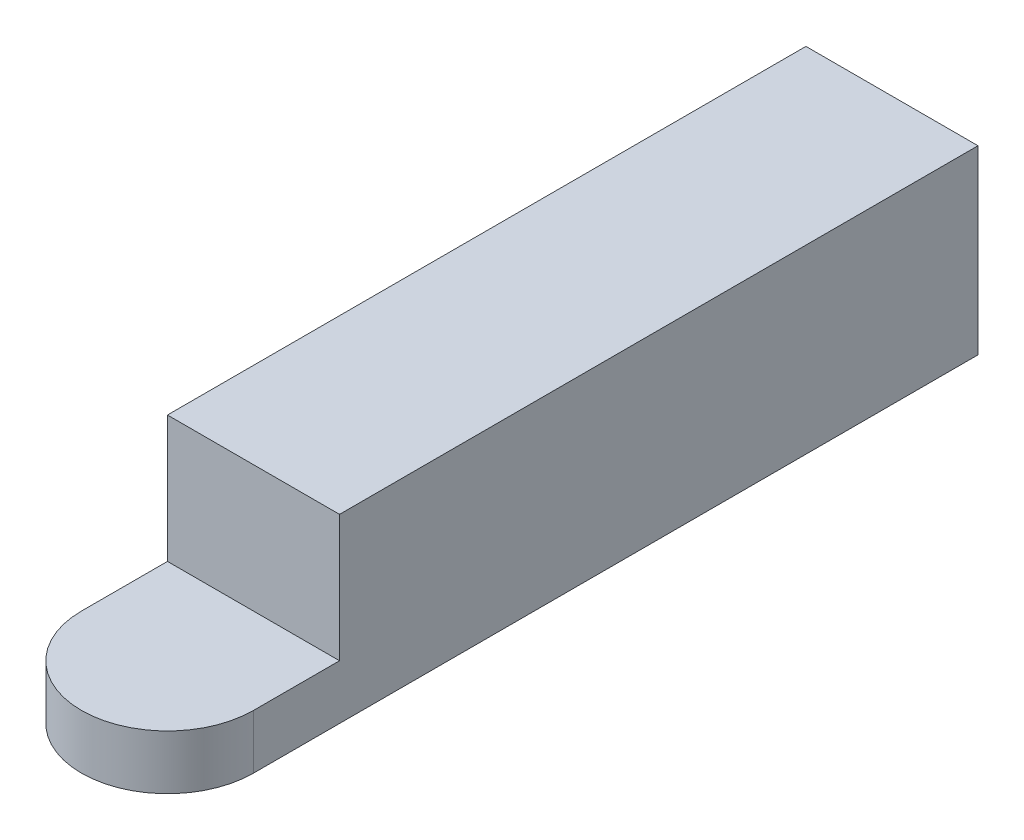
ISO-10303-21;
HEADER;
FILE_DESCRIPTION(('STEP AP214'),'2;1');
FILE_NAME('part.step','',(''),(''),'','','');
FILE_SCHEMA(('AUTOMOTIVE_DESIGN { 1 0 10303 214 1 1 1 1 }'));
ENDSEC;
DATA;
#1=APPLICATION_CONTEXT('core data for automotive mechanical design processes');
#2=APPLICATION_PROTOCOL_DEFINITION('international standard','automotive_design',2000,#1);
#3=PRODUCT_CONTEXT('',#1,'mechanical');
#4=PRODUCT('Part','Part','',(#3));
#5=PRODUCT_RELATED_PRODUCT_CATEGORY('part','',(#4));
#6=PRODUCT_DEFINITION_FORMATION('','',#4);
#7=PRODUCT_DEFINITION_CONTEXT('part definition',#1,'design');
#8=PRODUCT_DEFINITION('design','',#6,#7);
#9=PRODUCT_DEFINITION_SHAPE('','',#8);
#10=(LENGTH_UNIT() NAMED_UNIT(*) SI_UNIT(.MILLI.,.METRE.));
#11=(NAMED_UNIT(*) PLANE_ANGLE_UNIT() SI_UNIT($,.RADIAN.));
#12=(NAMED_UNIT(*) SI_UNIT($,.STERADIAN.) SOLID_ANGLE_UNIT());
#13=UNCERTAINTY_MEASURE_WITH_UNIT(LENGTH_MEASURE(1.E-05),#10,'distance_accuracy_value','');
#14=(GEOMETRIC_REPRESENTATION_CONTEXT(3) GLOBAL_UNCERTAINTY_ASSIGNED_CONTEXT((#13)) GLOBAL_UNIT_ASSIGNED_CONTEXT((#10,
#11,#12)) REPRESENTATION_CONTEXT('',''));
#15=CARTESIAN_POINT('',(0.,0.,0.));
#16=DIRECTION('',(0.,0.,1.));
#17=DIRECTION('',(1.,0.,0.));
#18=AXIS2_PLACEMENT_3D('',#15,#16,#17);
#19=CARTESIAN_POINT('',(4.75,10.,0.));
#20=DIRECTION('',(-1.,0.,0.));
#21=DIRECTION('',(0.,0.,1.));
#22=AXIS2_PLACEMENT_3D('',#19,#20,#21);
#23=PLANE('',#22);
#24=DIRECTION('',(0.,1.,0.));
#25=VECTOR('',#24,1.);
#26=CARTESIAN_POINT('',(4.75,3.,-4.75));
#27=LINE('',#26,#25);
#28=CARTESIAN_POINT('',(4.75,3.,-4.75));
#29=VERTEX_POINT('',#28);
#30=CARTESIAN_POINT('',(4.75,10.,-4.75));
#31=VERTEX_POINT('',#30);
#32=EDGE_CURVE('E165',#29,#31,#27,.T.);
#33=ORIENTED_EDGE('',*,*,#32,.F.);
#34=DIRECTION('',(0.,0.,-1.));
#35=VECTOR('',#34,1.);
#36=CARTESIAN_POINT('',(4.75,3.,0.));
#37=LINE('',#36,#35);
#38=CARTESIAN_POINT('',(4.75,3.,0.));
#39=VERTEX_POINT('',#38);
#40=EDGE_CURVE('E139',#39,#29,#37,.T.);
#41=ORIENTED_EDGE('',*,*,#40,.F.);
#42=DIRECTION('',(0.,-1.,0.));
#43=VECTOR('',#42,1.);
#44=CARTESIAN_POINT('',(4.75,10.,0.));
#45=LINE('',#44,#43);
#46=CARTESIAN_POINT('',(4.75,0.,0.));
#47=VERTEX_POINT('',#46);
#48=EDGE_CURVE('E103',#39,#47,#45,.T.);
#49=ORIENTED_EDGE('',*,*,#48,.T.);
#50=DIRECTION('',(0.,0.,-1.));
#51=VECTOR('',#50,1.);
#52=CARTESIAN_POINT('',(4.75,0.,0.));
#53=LINE('',#52,#51);
#54=CARTESIAN_POINT('',(4.75,0.,-40.));
#55=VERTEX_POINT('',#54);
#56=EDGE_CURVE('E101',#47,#55,#53,.T.);
#57=ORIENTED_EDGE('',*,*,#56,.T.);
#58=DIRECTION('',(0.,-1.,0.));
#59=VECTOR('',#58,1.);
#60=CARTESIAN_POINT('',(4.75,10.,-40.));
#61=LINE('',#60,#59);
#62=CARTESIAN_POINT('',(4.75,10.,-40.));
#63=VERTEX_POINT('',#62);
#64=EDGE_CURVE('E128',#63,#55,#61,.T.);
#65=ORIENTED_EDGE('',*,*,#64,.F.);
#66=DIRECTION('',(0.,0.,-1.));
#67=VECTOR('',#66,1.);
#68=CARTESIAN_POINT('',(4.75,10.,0.));
#69=LINE('',#68,#67);
#70=EDGE_CURVE('E117',#31,#63,#69,.T.);
#71=ORIENTED_EDGE('',*,*,#70,.F.);
#72=EDGE_LOOP('',(#33,#41,#49,#57,#65,#71));
#73=FACE_BOUND('',#72,.T.);
#74=ADVANCED_FACE('F58',(#73),#23,.F.);
#75=CARTESIAN_POINT('',(0.,10.,0.));
#76=DIRECTION('',(0.,1.,0.));
#77=DIRECTION('',(0.,0.,1.));
#78=AXIS2_PLACEMENT_3D('',#75,#76,#77);
#79=PLANE('',#78);
#80=DIRECTION('',(-1.,0.,0.));
#81=VECTOR('',#80,1.);
#82=CARTESIAN_POINT('',(0.,10.,-4.75));
#83=LINE('',#82,#81);
#84=CARTESIAN_POINT('',(-4.75,10.,-4.75));
#85=VERTEX_POINT('',#84);
#86=EDGE_CURVE('E159',#31,#85,#83,.T.);
#87=ORIENTED_EDGE('',*,*,#86,.F.);
#88=ORIENTED_EDGE('',*,*,#70,.T.);
#89=DIRECTION('',(-1.,0.,0.));
#90=VECTOR('',#89,1.);
#91=CARTESIAN_POINT('',(4.75,10.,-40.));
#92=LINE('',#91,#90);
#93=CARTESIAN_POINT('',(-4.75,10.,-40.));
#94=VERTEX_POINT('',#93);
#95=EDGE_CURVE('E82',#63,#94,#92,.T.);
#96=ORIENTED_EDGE('',*,*,#95,.T.);
#97=DIRECTION('',(0.,0.,1.));
#98=VECTOR('',#97,1.);
#99=CARTESIAN_POINT('',(-4.75,10.,0.));
#100=LINE('',#99,#98);
#101=EDGE_CURVE('E111',#94,#85,#100,.T.);
#102=ORIENTED_EDGE('',*,*,#101,.T.);
#103=EDGE_LOOP('',(#87,#88,#96,#102));
#104=FACE_BOUND('',#103,.T.);
#105=ADVANCED_FACE('F173',(#104),#79,.T.);
#106=CARTESIAN_POINT('',(0.,3.,0.));
#107=DIRECTION('',(0.,-1.,0.));
#108=DIRECTION('',(0.,0.,-1.));
#109=AXIS2_PLACEMENT_3D('',#106,#107,#108);
#110=CYLINDRICAL_SURFACE('',#109,4.75);
#111=ORIENTED_EDGE('',*,*,#48,.F.);
#112=CARTESIAN_POINT('',(0.,3.,0.));
#113=DIRECTION('',(0.,1.,0.));
#114=DIRECTION('',(0.,0.,1.));
#115=AXIS2_PLACEMENT_3D('',#112,#113,#114);
#116=CIRCLE('',#115,4.75);
#117=CARTESIAN_POINT('',(-4.75,3.,0.));
#118=VERTEX_POINT('',#117);
#119=EDGE_CURVE('E12',#118,#39,#116,.T.);
#120=ORIENTED_EDGE('',*,*,#119,.F.);
#121=DIRECTION('',(0.,-1.,0.));
#122=VECTOR('',#121,1.);
#123=CARTESIAN_POINT('',(-4.75,10.,0.));
#124=LINE('',#123,#122);
#125=CARTESIAN_POINT('',(-4.75,0.,0.));
#126=VERTEX_POINT('',#125);
#127=EDGE_CURVE('E106',#118,#126,#124,.T.);
#128=ORIENTED_EDGE('',*,*,#127,.T.);
#129=CARTESIAN_POINT('',(0.,0.,0.));
#130=DIRECTION('',(0.,1.,0.));
#131=DIRECTION('',(0.,0.,1.));
#132=AXIS2_PLACEMENT_3D('',#129,#130,#131);
#133=CIRCLE('',#132,4.75);
#134=EDGE_CURVE('E62',#126,#47,#133,.T.);
#135=ORIENTED_EDGE('',*,*,#134,.T.);
#136=EDGE_LOOP('',(#111,#120,#128,#135));
#137=FACE_BOUND('',#136,.T.);
#138=ADVANCED_FACE('F60',(#137),#110,.T.);
#139=CARTESIAN_POINT('',(0.,3.,0.));
#140=DIRECTION('',(0.,1.,0.));
#141=DIRECTION('',(0.,0.,1.));
#142=AXIS2_PLACEMENT_3D('',#139,#140,#141);
#143=PLANE('',#142);
#144=ORIENTED_EDGE('',*,*,#119,.T.);
#145=ORIENTED_EDGE('',*,*,#40,.T.);
#146=DIRECTION('',(-1.,0.,0.));
#147=VECTOR('',#146,1.);
#148=CARTESIAN_POINT('',(0.,3.,-4.75));
#149=LINE('',#148,#147);
#150=CARTESIAN_POINT('',(-4.75,3.,-4.75));
#151=VERTEX_POINT('',#150);
#152=EDGE_CURVE('E150',#29,#151,#149,.T.);
#153=ORIENTED_EDGE('',*,*,#152,.T.);
#154=DIRECTION('',(0.,0.,1.));
#155=VECTOR('',#154,1.);
#156=CARTESIAN_POINT('',(-4.75,3.,0.));
#157=LINE('',#156,#155);
#158=EDGE_CURVE('E147',#151,#118,#157,.T.);
#159=ORIENTED_EDGE('',*,*,#158,.T.);
#160=EDGE_LOOP('',(#144,#145,#153,#159));
#161=FACE_BOUND('',#160,.T.);
#162=ADVANCED_FACE('F145',(#161),#143,.T.);
#163=CARTESIAN_POINT('',(0.,0.,0.));
#164=DIRECTION('',(0.,1.,0.));
#165=DIRECTION('',(0.,0.,1.));
#166=AXIS2_PLACEMENT_3D('',#163,#164,#165);
#167=PLANE('',#166);
#168=ORIENTED_EDGE('',*,*,#134,.F.);
#169=DIRECTION('',(0.,0.,1.));
#170=VECTOR('',#169,1.);
#171=CARTESIAN_POINT('',(-4.75,0.,0.));
#172=LINE('',#171,#170);
#173=CARTESIAN_POINT('',(-4.75,0.,-40.));
#174=VERTEX_POINT('',#173);
#175=EDGE_CURVE('E100',#174,#126,#172,.T.);
#176=ORIENTED_EDGE('',*,*,#175,.F.);
#177=DIRECTION('',(-1.,0.,0.));
#178=VECTOR('',#177,1.);
#179=CARTESIAN_POINT('',(4.75,0.,-40.));
#180=LINE('',#179,#178);
#181=EDGE_CURVE('E118',#55,#174,#180,.T.);
#182=ORIENTED_EDGE('',*,*,#181,.F.);
#183=ORIENTED_EDGE('',*,*,#56,.F.);
#184=EDGE_LOOP('',(#168,#176,#182,#183));
#185=FACE_BOUND('',#184,.T.);
#186=ADVANCED_FACE('F97',(#185),#167,.F.);
#187=CARTESIAN_POINT('',(4.75,10.,-40.));
#188=DIRECTION('',(0.,0.,1.));
#189=DIRECTION('',(1.,0.,0.));
#190=AXIS2_PLACEMENT_3D('',#187,#188,#189);
#191=PLANE('',#190);
#192=ORIENTED_EDGE('',*,*,#181,.T.);
#193=DIRECTION('',(0.,-1.,0.));
#194=VECTOR('',#193,1.);
#195=CARTESIAN_POINT('',(-4.75,10.,-40.));
#196=LINE('',#195,#194);
#197=EDGE_CURVE('E110',#94,#174,#196,.T.);
#198=ORIENTED_EDGE('',*,*,#197,.F.);
#199=ORIENTED_EDGE('',*,*,#95,.F.);
#200=ORIENTED_EDGE('',*,*,#64,.T.);
#201=EDGE_LOOP('',(#192,#198,#199,#200));
#202=FACE_BOUND('',#201,.T.);
#203=ADVANCED_FACE('F184',(#202),#191,.F.);
#204=CARTESIAN_POINT('',(-4.75,10.,0.));
#205=DIRECTION('',(1.,0.,0.));
#206=DIRECTION('',(0.,0.,-1.));
#207=AXIS2_PLACEMENT_3D('',#204,#205,#206);
#208=PLANE('',#207);
#209=ORIENTED_EDGE('',*,*,#158,.F.);
#210=DIRECTION('',(0.,1.,0.));
#211=VECTOR('',#210,1.);
#212=CARTESIAN_POINT('',(-4.75,3.,-4.75));
#213=LINE('',#212,#211);
#214=EDGE_CURVE('E154',#151,#85,#213,.T.);
#215=ORIENTED_EDGE('',*,*,#214,.T.);
#216=ORIENTED_EDGE('',*,*,#101,.F.);
#217=ORIENTED_EDGE('',*,*,#197,.T.);
#218=ORIENTED_EDGE('',*,*,#175,.T.);
#219=ORIENTED_EDGE('',*,*,#127,.F.);
#220=EDGE_LOOP('',(#209,#215,#216,#217,#218,#219));
#221=FACE_BOUND('',#220,.T.);
#222=ADVANCED_FACE('F114',(#221),#208,.F.);
#223=CARTESIAN_POINT('',(0.,3.,-4.75));
#224=DIRECTION('',(0.,0.,-1.));
#225=DIRECTION('',(-1.,0.,0.));
#226=AXIS2_PLACEMENT_3D('',#223,#224,#225);
#227=PLANE('',#226);
#228=ORIENTED_EDGE('',*,*,#86,.T.);
#229=ORIENTED_EDGE('',*,*,#214,.F.);
#230=ORIENTED_EDGE('',*,*,#152,.F.);
#231=ORIENTED_EDGE('',*,*,#32,.T.);
#232=EDGE_LOOP('',(#228,#229,#230,#231));
#233=FACE_BOUND('',#232,.T.);
#234=ADVANCED_FACE('F177',(#233),#227,.F.);
#235=CLOSED_SHELL('',(#74,#105,#138,#162,#186,#203,#222,#234));
#236=MANIFOLD_SOLID_BREP('B2',#235);
#237=ADVANCED_BREP_SHAPE_REPRESENTATION('',(#18,#236),#14);
#238=SHAPE_DEFINITION_REPRESENTATION(#9,#237);
ENDSEC;
END-ISO-10303-21;
